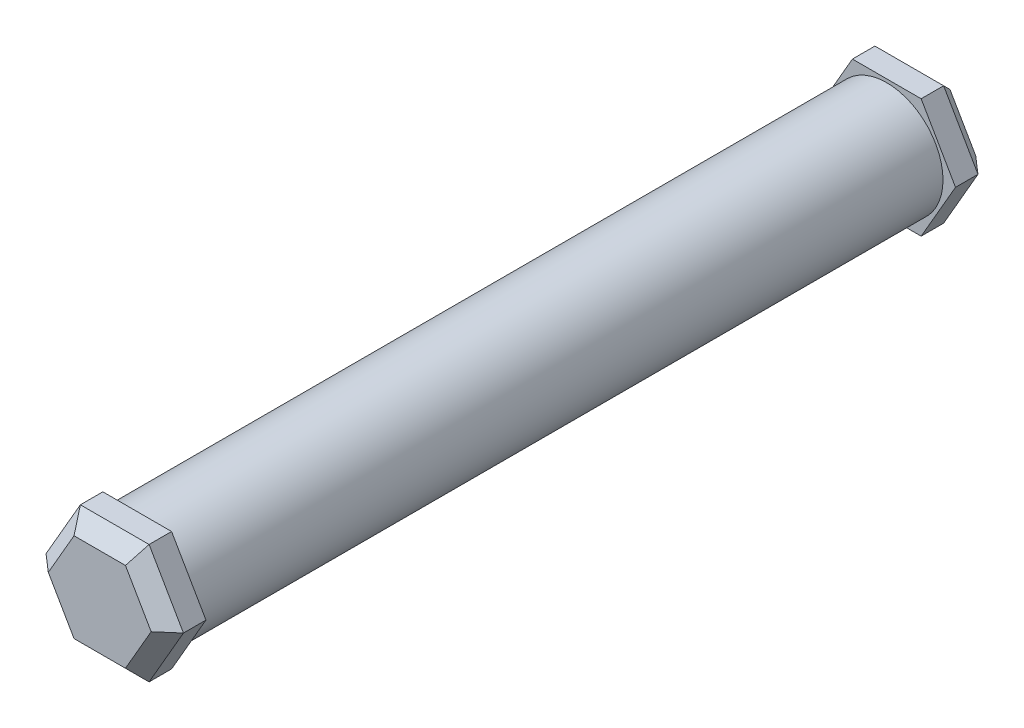
ISO-10303-21;
HEADER;
FILE_DESCRIPTION(('STEP AP214'),'2;1');
FILE_NAME('part.step','',(''),(''),'','','');
FILE_SCHEMA(('AUTOMOTIVE_DESIGN { 1 0 10303 214 1 1 1 1 }'));
ENDSEC;
DATA;
#1=APPLICATION_CONTEXT('core data for automotive mechanical design processes');
#2=APPLICATION_PROTOCOL_DEFINITION('international standard','automotive_design',2000,#1);
#3=PRODUCT_CONTEXT('',#1,'mechanical');
#4=PRODUCT('Part','Part','',(#3));
#5=PRODUCT_RELATED_PRODUCT_CATEGORY('part','',(#4));
#6=PRODUCT_DEFINITION_FORMATION('','',#4);
#7=PRODUCT_DEFINITION_CONTEXT('part definition',#1,'design');
#8=PRODUCT_DEFINITION('design','',#6,#7);
#9=PRODUCT_DEFINITION_SHAPE('','',#8);
#10=(LENGTH_UNIT() NAMED_UNIT(*) SI_UNIT(.MILLI.,.METRE.));
#11=(NAMED_UNIT(*) PLANE_ANGLE_UNIT() SI_UNIT($,.RADIAN.));
#12=(NAMED_UNIT(*) SI_UNIT($,.STERADIAN.) SOLID_ANGLE_UNIT());
#13=UNCERTAINTY_MEASURE_WITH_UNIT(LENGTH_MEASURE(1.E-05),#10,'distance_accuracy_value','');
#14=(GEOMETRIC_REPRESENTATION_CONTEXT(3) GLOBAL_UNCERTAINTY_ASSIGNED_CONTEXT((#13)) GLOBAL_UNIT_ASSIGNED_CONTEXT((#10,
#11,#12)) REPRESENTATION_CONTEXT('',''));
#15=CARTESIAN_POINT('',(0.,0.,0.));
#16=DIRECTION('',(0.,0.,1.));
#17=DIRECTION('',(1.,0.,0.));
#18=AXIS2_PLACEMENT_3D('',#15,#16,#17);
#19=CARTESIAN_POINT('',(0.,0.,200.));
#20=DIRECTION('',(0.,0.,-1.));
#21=DIRECTION('',(-1.,0.,0.));
#22=AXIS2_PLACEMENT_3D('',#19,#20,#21);
#23=CYLINDRICAL_SURFACE('',#22,15.);
#24=CARTESIAN_POINT('',(0.,0.,200.));
#25=DIRECTION('',(0.,0.,1.));
#26=DIRECTION('',(1.,0.,0.));
#27=AXIS2_PLACEMENT_3D('',#24,#25,#26);
#28=CIRCLE('',#27,15.);
#29=CARTESIAN_POINT('',(15.,0.,200.));
#30=VERTEX_POINT('',#29);
#31=EDGE_CURVE('E269',#30,#30,#28,.T.);
#32=ORIENTED_EDGE('',*,*,#31,.F.);
#33=EDGE_LOOP('',(#32));
#34=FACE_BOUND('',#33,.T.);
#35=CARTESIAN_POINT('',(0.,0.,0.));
#36=DIRECTION('',(0.,0.,1.));
#37=DIRECTION('',(1.,0.,0.));
#38=AXIS2_PLACEMENT_3D('',#35,#36,#37);
#39=CIRCLE('',#38,15.);
#40=CARTESIAN_POINT('',(15.,0.,0.));
#41=VERTEX_POINT('',#40);
#42=EDGE_CURVE('E268',#41,#41,#39,.T.);
#43=ORIENTED_EDGE('',*,*,#42,.T.);
#44=EDGE_LOOP('',(#43));
#45=FACE_BOUND('',#44,.T.);
#46=ADVANCED_FACE('F41',(#34,#45),#23,.T.);
#47=CARTESIAN_POINT('',(-9.16933017149542,-15.8817457284041,-10.));
#48=DIRECTION('',(0.866025403784438,0.500000000000001,0.));
#49=DIRECTION('',(-0.500000000000001,0.866025403784438,0.));
#50=AXIS2_PLACEMENT_3D('',#47,#48,#49);
#51=PLANE('',#50);
#52=DIRECTION('',(0.,0.,1.));
#53=VECTOR('',#52,1.);
#54=CARTESIAN_POINT('',(-18.3386603429907,-1.28058180733869E-13,-10.));
#55=LINE('',#54,#53);
#56=CARTESIAN_POINT('',(-18.3386603429907,-1.28058180733869E-13,-5.99999999999997));
#57=VERTEX_POINT('',#56);
#58=CARTESIAN_POINT('',(-18.3386603429907,-1.28058180733869E-13,0.));
#59=VERTEX_POINT('',#58);
#60=EDGE_CURVE('E265',#57,#59,#55,.T.);
#61=ORIENTED_EDGE('',*,*,#60,.F.);
#62=DIRECTION('',(0.500000000000001,-0.866025403784438,0.));
#63=VECTOR('',#62,1.);
#64=CARTESIAN_POINT('',(-9.16933017149542,-15.8817457284041,-5.99999999999997));
#65=LINE('',#64,#63);
#66=CARTESIAN_POINT('',(-9.16933017149542,-15.8817457284041,-5.99999999999997));
#67=VERTEX_POINT('',#66);
#68=EDGE_CURVE('E311',#57,#67,#65,.T.);
#69=ORIENTED_EDGE('',*,*,#68,.T.);
#70=DIRECTION('',(0.,0.,1.));
#71=VECTOR('',#70,1.);
#72=CARTESIAN_POINT('',(-9.16933017149542,-15.8817457284041,-10.));
#73=LINE('',#72,#71);
#74=CARTESIAN_POINT('',(-9.16933017149542,-15.8817457284041,0.));
#75=VERTEX_POINT('',#74);
#76=EDGE_CURVE('E250',#67,#75,#73,.T.);
#77=ORIENTED_EDGE('',*,*,#76,.T.);
#78=DIRECTION('',(-0.500000000000001,0.866025403784438,0.));
#79=VECTOR('',#78,1.);
#80=CARTESIAN_POINT('',(-9.16933017149542,-15.8817457284041,0.));
#81=LINE('',#80,#79);
#82=EDGE_CURVE('E176',#75,#59,#81,.T.);
#83=ORIENTED_EDGE('',*,*,#82,.T.);
#84=EDGE_LOOP('',(#61,#69,#77,#83));
#85=FACE_BOUND('',#84,.T.);
#86=ADVANCED_FACE('F427',(#85),#51,.F.);
#87=CARTESIAN_POINT('',(-18.3386603429907,-1.28058180733869E-13,-10.));
#88=DIRECTION('',(0.866025403784442,-0.499999999999995,0.));
#89=DIRECTION('',(0.499999999999995,0.866025403784442,0.));
#90=AXIS2_PLACEMENT_3D('',#87,#88,#89);
#91=PLANE('',#90);
#92=DIRECTION('',(0.,0.,1.));
#93=VECTOR('',#92,1.);
#94=CARTESIAN_POINT('',(-9.16933017149542,15.8817457284041,-10.));
#95=LINE('',#94,#93);
#96=CARTESIAN_POINT('',(-9.16933017149542,15.8817457284041,-5.99999999999997));
#97=VERTEX_POINT('',#96);
#98=CARTESIAN_POINT('',(-9.16933017149542,15.8817457284041,0.));
#99=VERTEX_POINT('',#98);
#100=EDGE_CURVE('E262',#97,#99,#95,.T.);
#101=ORIENTED_EDGE('',*,*,#100,.F.);
#102=DIRECTION('',(-0.499999999999995,-0.866025403784442,0.));
#103=VECTOR('',#102,1.);
#104=CARTESIAN_POINT('',(-18.3386603429907,-1.28369537222284E-13,-5.99999999999997));
#105=LINE('',#104,#103);
#106=EDGE_CURVE('E308',#97,#57,#105,.T.);
#107=ORIENTED_EDGE('',*,*,#106,.T.);
#108=ORIENTED_EDGE('',*,*,#60,.T.);
#109=DIRECTION('',(0.499999999999995,0.866025403784442,0.));
#110=VECTOR('',#109,1.);
#111=CARTESIAN_POINT('',(-18.3386603429907,-1.28058180733869E-13,0.));
#112=LINE('',#111,#110);
#113=EDGE_CURVE('E230',#59,#99,#112,.T.);
#114=ORIENTED_EDGE('',*,*,#113,.T.);
#115=EDGE_LOOP('',(#101,#107,#108,#114));
#116=FACE_BOUND('',#115,.T.);
#117=ADVANCED_FACE('F433',(#116),#91,.F.);
#118=CARTESIAN_POINT('',(-9.16933017149542,15.8817457284041,-10.));
#119=DIRECTION('',(0.,-1.,0.));
#120=DIRECTION('',(1.,0.,0.));
#121=AXIS2_PLACEMENT_3D('',#118,#119,#120);
#122=PLANE('',#121);
#123=DIRECTION('',(0.,0.,1.));
#124=VECTOR('',#123,1.);
#125=CARTESIAN_POINT('',(9.1693301714953,15.8817457284042,-10.));
#126=LINE('',#125,#124);
#127=CARTESIAN_POINT('',(9.1693301714953,15.8817457284042,-5.99999999999997));
#128=VERTEX_POINT('',#127);
#129=CARTESIAN_POINT('',(9.1693301714953,15.8817457284042,0.));
#130=VERTEX_POINT('',#129);
#131=EDGE_CURVE('E259',#128,#130,#126,.T.);
#132=ORIENTED_EDGE('',*,*,#131,.F.);
#133=DIRECTION('',(-1.,0.,0.));
#134=VECTOR('',#133,1.);
#135=CARTESIAN_POINT('',(-9.16933017149542,15.8817457284041,-5.99999999999997));
#136=LINE('',#135,#134);
#137=EDGE_CURVE('E305',#128,#97,#136,.T.);
#138=ORIENTED_EDGE('',*,*,#137,.T.);
#139=ORIENTED_EDGE('',*,*,#100,.T.);
#140=DIRECTION('',(1.,0.,0.));
#141=VECTOR('',#140,1.);
#142=CARTESIAN_POINT('',(-9.16933017149542,15.8817457284041,0.));
#143=LINE('',#142,#141);
#144=EDGE_CURVE('E234',#99,#130,#143,.T.);
#145=ORIENTED_EDGE('',*,*,#144,.T.);
#146=EDGE_LOOP('',(#132,#138,#139,#145));
#147=FACE_BOUND('',#146,.T.);
#148=ADVANCED_FACE('F628',(#147),#122,.F.);
#149=CARTESIAN_POINT('',(9.1693301714953,15.8817457284042,-10.));
#150=DIRECTION('',(-0.866025403784438,-0.500000000000001,0.));
#151=DIRECTION('',(0.500000000000001,-0.866025403784438,0.));
#152=AXIS2_PLACEMENT_3D('',#149,#150,#151);
#153=PLANE('',#152);
#154=DIRECTION('',(0.,0.,1.));
#155=VECTOR('',#154,1.);
#156=CARTESIAN_POINT('',(18.3386603429907,0.,-10.));
#157=LINE('',#156,#155);
#158=CARTESIAN_POINT('',(18.3386603429907,0.,-5.99999999999997));
#159=VERTEX_POINT('',#158);
#160=CARTESIAN_POINT('',(18.3386603429907,0.,0.));
#161=VERTEX_POINT('',#160);
#162=EDGE_CURVE('E256',#159,#161,#157,.T.);
#163=ORIENTED_EDGE('',*,*,#162,.F.);
#164=DIRECTION('',(-0.500000000000001,0.866025403784438,0.));
#165=VECTOR('',#164,1.);
#166=CARTESIAN_POINT('',(9.1693301714953,15.8817457284042,-5.99999999999997));
#167=LINE('',#166,#165);
#168=EDGE_CURVE('E302',#159,#128,#167,.T.);
#169=ORIENTED_EDGE('',*,*,#168,.T.);
#170=ORIENTED_EDGE('',*,*,#131,.T.);
#171=DIRECTION('',(0.500000000000001,-0.866025403784438,0.));
#172=VECTOR('',#171,1.);
#173=CARTESIAN_POINT('',(9.1693301714953,15.8817457284042,0.));
#174=LINE('',#173,#172);
#175=EDGE_CURVE('E238',#130,#161,#174,.T.);
#176=ORIENTED_EDGE('',*,*,#175,.T.);
#177=EDGE_LOOP('',(#163,#169,#170,#176));
#178=FACE_BOUND('',#177,.T.);
#179=ADVANCED_FACE('F618',(#178),#153,.F.);
#180=CARTESIAN_POINT('',(18.3386603429907,0.,-10.));
#181=DIRECTION('',(-0.866025403784438,0.500000000000001,0.));
#182=DIRECTION('',(-0.500000000000001,-0.866025403784438,0.));
#183=AXIS2_PLACEMENT_3D('',#180,#181,#182);
#184=PLANE('',#183);
#185=DIRECTION('',(0.,0.,1.));
#186=VECTOR('',#185,1.);
#187=CARTESIAN_POINT('',(9.1693301714953,-15.8817457284042,-10.));
#188=LINE('',#187,#186);
#189=CARTESIAN_POINT('',(9.1693301714953,-15.8817457284042,-5.99999999999997));
#190=VERTEX_POINT('',#189);
#191=CARTESIAN_POINT('',(9.1693301714953,-15.8817457284042,0.));
#192=VERTEX_POINT('',#191);
#193=EDGE_CURVE('E253',#190,#192,#188,.T.);
#194=ORIENTED_EDGE('',*,*,#193,.F.);
#195=DIRECTION('',(0.500000000000001,0.866025403784438,0.));
#196=VECTOR('',#195,1.);
#197=CARTESIAN_POINT('',(18.3386603429907,0.,-5.99999999999997));
#198=LINE('',#197,#196);
#199=EDGE_CURVE('E299',#190,#159,#198,.T.);
#200=ORIENTED_EDGE('',*,*,#199,.T.);
#201=ORIENTED_EDGE('',*,*,#162,.T.);
#202=DIRECTION('',(-0.500000000000001,-0.866025403784438,0.));
#203=VECTOR('',#202,1.);
#204=CARTESIAN_POINT('',(18.3386603429907,0.,0.));
#205=LINE('',#204,#203);
#206=EDGE_CURVE('E242',#161,#192,#205,.T.);
#207=ORIENTED_EDGE('',*,*,#206,.T.);
#208=EDGE_LOOP('',(#194,#200,#201,#207));
#209=FACE_BOUND('',#208,.T.);
#210=ADVANCED_FACE('F608',(#209),#184,.F.);
#211=CARTESIAN_POINT('',(9.1693301714953,-15.8817457284042,-10.));
#212=DIRECTION('',(0.,1.,0.));
#213=DIRECTION('',(-1.,0.,0.));
#214=AXIS2_PLACEMENT_3D('',#211,#212,#213);
#215=PLANE('',#214);
#216=ORIENTED_EDGE('',*,*,#76,.F.);
#217=DIRECTION('',(1.,0.,0.));
#218=VECTOR('',#217,1.);
#219=CARTESIAN_POINT('',(9.1693301714953,-15.8817457284042,-5.99999999999997));
#220=LINE('',#219,#218);
#221=EDGE_CURVE('E295',#67,#190,#220,.T.);
#222=ORIENTED_EDGE('',*,*,#221,.T.);
#223=ORIENTED_EDGE('',*,*,#193,.T.);
#224=DIRECTION('',(-1.,0.,0.));
#225=VECTOR('',#224,1.);
#226=CARTESIAN_POINT('',(9.1693301714953,-15.8817457284042,0.));
#227=LINE('',#226,#225);
#228=EDGE_CURVE('E246',#192,#75,#227,.T.);
#229=ORIENTED_EDGE('',*,*,#228,.T.);
#230=EDGE_LOOP('',(#216,#222,#223,#229));
#231=FACE_BOUND('',#230,.T.);
#232=ADVANCED_FACE('F598',(#231),#215,.F.);
#233=CARTESIAN_POINT('',(0.,0.,-10.));
#234=DIRECTION('',(0.,0.,-1.));
#235=DIRECTION('',(-1.,0.,0.));
#236=AXIS2_PLACEMENT_3D('',#233,#234,#235);
#237=PLANE('',#236);
#238=DIRECTION('',(-0.500000000000001,-0.866025403784438,0.));
#239=VECTOR('',#238,1.);
#240=CARTESIAN_POINT('',(5.70522855635753,-13.8817457284042,-10.));
#241=LINE('',#240,#239);
#242=CARTESIAN_POINT('',(13.7198581894736,0.,-10.));
#243=VERTEX_POINT('',#242);
#244=CARTESIAN_POINT('',(6.8599290947368,-11.8817457284042,-10.));
#245=VERTEX_POINT('',#244);
#246=EDGE_CURVE('E288',#243,#245,#241,.T.);
#247=ORIENTED_EDGE('',*,*,#246,.T.);
#248=DIRECTION('',(-1.,0.,0.));
#249=VECTOR('',#248,1.);
#250=CARTESIAN_POINT('',(-9.1693301714954,-11.8817457284041,-10.));
#251=LINE('',#250,#249);
#252=CARTESIAN_POINT('',(-6.8599290947369,-11.8817457284041,-10.));
#253=VERTEX_POINT('',#252);
#254=EDGE_CURVE('E291',#245,#253,#251,.T.);
#255=ORIENTED_EDGE('',*,*,#254,.T.);
#256=DIRECTION('',(-0.500000000000001,0.866025403784438,0.));
#257=VECTOR('',#256,1.);
#258=CARTESIAN_POINT('',(-14.8745587278529,1.99999999999989,-10.));
#259=LINE('',#258,#257);
#260=CARTESIAN_POINT('',(-13.7198581894737,-1.09537694663182E-13,-10.));
#261=VERTEX_POINT('',#260);
#262=EDGE_CURVE('E273',#253,#261,#259,.T.);
#263=ORIENTED_EDGE('',*,*,#262,.T.);
#264=DIRECTION('',(0.499999999999995,0.866025403784442,0.));
#265=VECTOR('',#264,1.);
#266=CARTESIAN_POINT('',(-5.70522855635763,13.8817457284041,-10.));
#267=LINE('',#266,#265);
#268=CARTESIAN_POINT('',(-6.85992909473688,11.8817457284041,-10.));
#269=VERTEX_POINT('',#268);
#270=EDGE_CURVE('E279',#261,#269,#267,.T.);
#271=ORIENTED_EDGE('',*,*,#270,.T.);
#272=DIRECTION('',(1.,0.,0.));
#273=VECTOR('',#272,1.);
#274=CARTESIAN_POINT('',(9.16933017149532,11.8817457284042,-10.));
#275=LINE('',#274,#273);
#276=CARTESIAN_POINT('',(6.85992909473679,11.8817457284042,-10.));
#277=VERTEX_POINT('',#276);
#278=EDGE_CURVE('E282',#269,#277,#275,.T.);
#279=ORIENTED_EDGE('',*,*,#278,.T.);
#280=DIRECTION('',(0.500000000000001,-0.866025403784438,0.));
#281=VECTOR('',#280,1.);
#282=CARTESIAN_POINT('',(14.8745587278529,-2.00000000000001,-10.));
#283=LINE('',#282,#281);
#284=EDGE_CURVE('E285',#277,#243,#283,.T.);
#285=ORIENTED_EDGE('',*,*,#284,.T.);
#286=EDGE_LOOP('',(#247,#255,#263,#271,#279,#285));
#287=FACE_BOUND('',#286,.T.);
#288=ADVANCED_FACE('F593',(#287),#237,.T.);
#289=CARTESIAN_POINT('',(0.,0.,0.));
#290=DIRECTION('',(0.,0.,-1.));
#291=DIRECTION('',(-1.,0.,0.));
#292=AXIS2_PLACEMENT_3D('',#289,#290,#291);
#293=PLANE('',#292);
#294=ORIENTED_EDGE('',*,*,#42,.F.);
#295=EDGE_LOOP('',(#294));
#296=FACE_BOUND('',#295,.T.);
#297=ORIENTED_EDGE('',*,*,#82,.F.);
#298=ORIENTED_EDGE('',*,*,#228,.F.);
#299=ORIENTED_EDGE('',*,*,#206,.F.);
#300=ORIENTED_EDGE('',*,*,#175,.F.);
#301=ORIENTED_EDGE('',*,*,#144,.F.);
#302=ORIENTED_EDGE('',*,*,#113,.F.);
#303=EDGE_LOOP('',(#297,#298,#299,#300,#301,#302));
#304=FACE_BOUND('',#303,.T.);
#305=ADVANCED_FACE('F586',(#296,#304),#293,.F.);
#306=CARTESIAN_POINT('',(9.16933017149553,-15.8817457284041,210.));
#307=DIRECTION('',(-0.866025403784442,0.499999999999995,0.));
#308=DIRECTION('',(-0.499999999999995,-0.866025403784442,0.));
#309=AXIS2_PLACEMENT_3D('',#306,#307,#308);
#310=PLANE('',#309);
#311=DIRECTION('',(0.,0.,-1.));
#312=VECTOR('',#311,1.);
#313=CARTESIAN_POINT('',(18.3386603429907,0.,210.));
#314=LINE('',#313,#312);
#315=CARTESIAN_POINT('',(18.3386603429907,0.,206.));
#316=VERTEX_POINT('',#315);
#317=CARTESIAN_POINT('',(18.3386603429907,0.,200.));
#318=VERTEX_POINT('',#317);
#319=EDGE_CURVE('E167',#316,#318,#314,.T.);
#320=ORIENTED_EDGE('',*,*,#319,.F.);
#321=DIRECTION('',(-0.499999999999995,-0.866025403784442,0.));
#322=VECTOR('',#321,1.);
#323=CARTESIAN_POINT('',(9.16933017149553,-15.8817457284041,206.));
#324=LINE('',#323,#322);
#325=CARTESIAN_POINT('',(9.16933017149553,-15.8817457284041,206.));
#326=VERTEX_POINT('',#325);
#327=EDGE_CURVE('E11',#316,#326,#324,.T.);
#328=ORIENTED_EDGE('',*,*,#327,.T.);
#329=DIRECTION('',(0.,0.,-1.));
#330=VECTOR('',#329,1.);
#331=CARTESIAN_POINT('',(9.16933017149553,-15.8817457284041,210.));
#332=LINE('',#331,#330);
#333=CARTESIAN_POINT('',(9.16933017149553,-15.8817457284041,200.));
#334=VERTEX_POINT('',#333);
#335=EDGE_CURVE('E191',#326,#334,#332,.T.);
#336=ORIENTED_EDGE('',*,*,#335,.T.);
#337=DIRECTION('',(0.499999999999995,0.866025403784441,0.));
#338=VECTOR('',#337,1.);
#339=CARTESIAN_POINT('',(9.16933017149553,-15.8817457284041,200.));
#340=LINE('',#339,#338);
#341=EDGE_CURVE('E183',#334,#318,#340,.T.);
#342=ORIENTED_EDGE('',*,*,#341,.T.);
#343=EDGE_LOOP('',(#320,#328,#336,#342));
#344=FACE_BOUND('',#343,.T.);
#345=ADVANCED_FACE('F189',(#344),#310,.F.);
#346=CARTESIAN_POINT('',(18.3386603429907,0.,210.));
#347=DIRECTION('',(-0.866025403784438,-0.500000000000001,0.));
#348=DIRECTION('',(0.500000000000001,-0.866025403784438,0.));
#349=AXIS2_PLACEMENT_3D('',#346,#347,#348);
#350=PLANE('',#349);
#351=DIRECTION('',(0.,0.,-1.));
#352=VECTOR('',#351,1.);
#353=CARTESIAN_POINT('',(9.16933017149531,15.8817457284042,210.));
#354=LINE('',#353,#352);
#355=CARTESIAN_POINT('',(9.16933017149531,15.8817457284042,206.));
#356=VERTEX_POINT('',#355);
#357=CARTESIAN_POINT('',(9.16933017149531,15.8817457284042,200.));
#358=VERTEX_POINT('',#357);
#359=EDGE_CURVE('E177',#356,#358,#354,.T.);
#360=ORIENTED_EDGE('',*,*,#359,.F.);
#361=DIRECTION('',(0.500000000000001,-0.866025403784438,0.));
#362=VECTOR('',#361,1.);
#363=CARTESIAN_POINT('',(18.3386603429907,0.,206.));
#364=LINE('',#363,#362);
#365=EDGE_CURVE('E52',#356,#316,#364,.T.);
#366=ORIENTED_EDGE('',*,*,#365,.T.);
#367=ORIENTED_EDGE('',*,*,#319,.T.);
#368=DIRECTION('',(-0.500000000000001,0.866025403784438,0.));
#369=VECTOR('',#368,1.);
#370=CARTESIAN_POINT('',(18.3386603429907,0.,200.));
#371=LINE('',#370,#369);
#372=EDGE_CURVE('E170',#318,#358,#371,.T.);
#373=ORIENTED_EDGE('',*,*,#372,.T.);
#374=EDGE_LOOP('',(#360,#366,#367,#373));
#375=FACE_BOUND('',#374,.T.);
#376=ADVANCED_FACE('F169',(#375),#350,.F.);
#377=CARTESIAN_POINT('',(9.16933017149531,15.8817457284042,210.));
#378=DIRECTION('',(0.,-1.,0.));
#379=DIRECTION('',(1.,0.,0.));
#380=AXIS2_PLACEMENT_3D('',#377,#378,#379);
#381=PLANE('',#380);
#382=DIRECTION('',(0.,0.,-1.));
#383=VECTOR('',#382,1.);
#384=CARTESIAN_POINT('',(-9.16933017149542,15.8817457284041,210.));
#385=LINE('',#384,#383);
#386=CARTESIAN_POINT('',(-9.16933017149542,15.8817457284041,206.));
#387=VERTEX_POINT('',#386);
#388=CARTESIAN_POINT('',(-9.16933017149542,15.8817457284041,200.));
#389=VERTEX_POINT('',#388);
#390=EDGE_CURVE('E222',#387,#389,#385,.T.);
#391=ORIENTED_EDGE('',*,*,#390,.F.);
#392=DIRECTION('',(1.,0.,0.));
#393=VECTOR('',#392,1.);
#394=CARTESIAN_POINT('',(9.16933017149531,15.8817457284042,206.));
#395=LINE('',#394,#393);
#396=EDGE_CURVE('E67',#387,#356,#395,.T.);
#397=ORIENTED_EDGE('',*,*,#396,.T.);
#398=ORIENTED_EDGE('',*,*,#359,.T.);
#399=DIRECTION('',(-1.,0.,0.));
#400=VECTOR('',#399,1.);
#401=CARTESIAN_POINT('',(9.16933017149531,15.8817457284042,200.));
#402=LINE('',#401,#400);
#403=EDGE_CURVE('E186',#358,#389,#402,.T.);
#404=ORIENTED_EDGE('',*,*,#403,.T.);
#405=EDGE_LOOP('',(#391,#397,#398,#404));
#406=FACE_BOUND('',#405,.T.);
#407=ADVANCED_FACE('F417',(#406),#381,.F.);
#408=CARTESIAN_POINT('',(-9.16933017149542,15.8817457284041,210.));
#409=DIRECTION('',(0.866025403784442,-0.499999999999995,0.));
#410=DIRECTION('',(0.499999999999995,0.866025403784442,0.));
#411=AXIS2_PLACEMENT_3D('',#408,#409,#410);
#412=PLANE('',#411);
#413=DIRECTION('',(0.,0.,-1.));
#414=VECTOR('',#413,1.);
#415=CARTESIAN_POINT('',(-18.3386603429907,-1.28058180733869E-13,210.));
#416=LINE('',#415,#414);
#417=CARTESIAN_POINT('',(-18.3386603429907,-1.28058180733869E-13,206.));
#418=VERTEX_POINT('',#417);
#419=CARTESIAN_POINT('',(-18.3386603429907,-1.28058180733869E-13,200.));
#420=VERTEX_POINT('',#419);
#421=EDGE_CURVE('E219',#418,#420,#416,.T.);
#422=ORIENTED_EDGE('',*,*,#421,.F.);
#423=DIRECTION('',(0.499999999999995,0.866025403784442,0.));
#424=VECTOR('',#423,1.);
#425=CARTESIAN_POINT('',(-9.16933017149542,15.8817457284041,206.));
#426=LINE('',#425,#424);
#427=EDGE_CURVE('E340',#418,#387,#426,.T.);
#428=ORIENTED_EDGE('',*,*,#427,.T.);
#429=ORIENTED_EDGE('',*,*,#390,.T.);
#430=DIRECTION('',(-0.499999999999995,-0.866025403784442,0.));
#431=VECTOR('',#430,1.);
#432=CARTESIAN_POINT('',(-9.16933017149542,15.8817457284041,200.));
#433=LINE('',#432,#431);
#434=EDGE_CURVE('E203',#389,#420,#433,.T.);
#435=ORIENTED_EDGE('',*,*,#434,.T.);
#436=EDGE_LOOP('',(#422,#428,#429,#435));
#437=FACE_BOUND('',#436,.T.);
#438=ADVANCED_FACE('F415',(#437),#412,.F.);
#439=CARTESIAN_POINT('',(-18.3386603429907,-1.28058180733869E-13,210.));
#440=DIRECTION('',(0.866025403784435,0.500000000000007,0.));
#441=DIRECTION('',(-0.500000000000007,0.866025403784435,0.));
#442=AXIS2_PLACEMENT_3D('',#439,#440,#441);
#443=PLANE('',#442);
#444=DIRECTION('',(0.,0.,-1.));
#445=VECTOR('',#444,1.);
#446=CARTESIAN_POINT('',(-9.1693301714952,-15.8817457284043,210.));
#447=LINE('',#446,#445);
#448=CARTESIAN_POINT('',(-9.1693301714952,-15.8817457284043,206.));
#449=VERTEX_POINT('',#448);
#450=CARTESIAN_POINT('',(-9.1693301714952,-15.8817457284043,200.));
#451=VERTEX_POINT('',#450);
#452=EDGE_CURVE('E216',#449,#451,#447,.T.);
#453=ORIENTED_EDGE('',*,*,#452,.F.);
#454=DIRECTION('',(-0.500000000000007,0.866025403784435,0.));
#455=VECTOR('',#454,1.);
#456=CARTESIAN_POINT('',(-18.3386603429907,-1.28369537222284E-13,206.));
#457=LINE('',#456,#455);
#458=EDGE_CURVE('E337',#449,#418,#457,.T.);
#459=ORIENTED_EDGE('',*,*,#458,.T.);
#460=ORIENTED_EDGE('',*,*,#421,.T.);
#461=DIRECTION('',(0.500000000000007,-0.866025403784435,0.));
#462=VECTOR('',#461,1.);
#463=CARTESIAN_POINT('',(-18.3386603429907,-1.28058180733869E-13,200.));
#464=LINE('',#463,#462);
#465=EDGE_CURVE('E207',#420,#451,#464,.T.);
#466=ORIENTED_EDGE('',*,*,#465,.T.);
#467=EDGE_LOOP('',(#453,#459,#460,#466));
#468=FACE_BOUND('',#467,.T.);
#469=ADVANCED_FACE('F413',(#468),#443,.F.);
#470=CARTESIAN_POINT('',(-9.1693301714952,-15.8817457284043,210.));
#471=DIRECTION('',(0.,1.,0.));
#472=DIRECTION('',(-1.,0.,0.));
#473=AXIS2_PLACEMENT_3D('',#470,#471,#472);
#474=PLANE('',#473);
#475=ORIENTED_EDGE('',*,*,#335,.F.);
#476=DIRECTION('',(-1.,0.,0.));
#477=VECTOR('',#476,1.);
#478=CARTESIAN_POINT('',(-9.1693301714952,-15.8817457284043,206.));
#479=LINE('',#478,#477);
#480=EDGE_CURVE('E333',#326,#449,#479,.T.);
#481=ORIENTED_EDGE('',*,*,#480,.T.);
#482=ORIENTED_EDGE('',*,*,#452,.T.);
#483=DIRECTION('',(1.,0.,0.));
#484=VECTOR('',#483,1.);
#485=CARTESIAN_POINT('',(-9.1693301714952,-15.8817457284043,200.));
#486=LINE('',#485,#484);
#487=EDGE_CURVE('E211',#451,#334,#486,.T.);
#488=ORIENTED_EDGE('',*,*,#487,.T.);
#489=EDGE_LOOP('',(#475,#481,#482,#488));
#490=FACE_BOUND('',#489,.T.);
#491=ADVANCED_FACE('F401',(#490),#474,.F.);
#492=CARTESIAN_POINT('',(0.,0.,210.));
#493=DIRECTION('',(0.,0.,1.));
#494=DIRECTION('',(1.,0.,0.));
#495=AXIS2_PLACEMENT_3D('',#492,#493,#494);
#496=PLANE('',#495);
#497=DIRECTION('',(0.500000000000007,-0.866025403784435,0.));
#498=VECTOR('',#497,1.);
#499=CARTESIAN_POINT('',(-5.70522855635745,-13.8817457284042,210.));
#500=LINE('',#499,#498);
#501=CARTESIAN_POINT('',(-13.7198581894737,0.,210.));
#502=VERTEX_POINT('',#501);
#503=CARTESIAN_POINT('',(-6.85992909473672,-11.8817457284042,210.));
#504=VERTEX_POINT('',#503);
#505=EDGE_CURVE('E326',#502,#504,#500,.T.);
#506=ORIENTED_EDGE('',*,*,#505,.T.);
#507=DIRECTION('',(1.,0.,0.));
#508=VECTOR('',#507,1.);
#509=CARTESIAN_POINT('',(9.16933017149549,-11.8817457284041,210.));
#510=LINE('',#509,#508);
#511=CARTESIAN_POINT('',(6.85992909473699,-11.8817457284041,210.));
#512=VERTEX_POINT('',#511);
#513=EDGE_CURVE('E329',#504,#512,#510,.T.);
#514=ORIENTED_EDGE('',*,*,#513,.T.);
#515=DIRECTION('',(0.499999999999995,0.866025403784442,0.));
#516=VECTOR('',#515,1.);
#517=CARTESIAN_POINT('',(14.8745587278529,1.99999999999998,210.));
#518=LINE('',#517,#516);
#519=CARTESIAN_POINT('',(13.7198581894737,0.,210.));
#520=VERTEX_POINT('',#519);
#521=EDGE_CURVE('E314',#512,#520,#518,.T.);
#522=ORIENTED_EDGE('',*,*,#521,.T.);
#523=DIRECTION('',(-0.500000000000001,0.866025403784438,0.));
#524=VECTOR('',#523,1.);
#525=CARTESIAN_POINT('',(5.70522855635755,13.8817457284042,210.));
#526=LINE('',#525,#524);
#527=CARTESIAN_POINT('',(6.85992909473681,11.8817457284042,210.));
#528=VERTEX_POINT('',#527);
#529=EDGE_CURVE('E317',#520,#528,#526,.T.);
#530=ORIENTED_EDGE('',*,*,#529,.T.);
#531=DIRECTION('',(-1.,0.,0.));
#532=VECTOR('',#531,1.);
#533=CARTESIAN_POINT('',(-9.1693301714954,11.8817457284041,210.));
#534=LINE('',#533,#532);
#535=CARTESIAN_POINT('',(-6.85992909473688,11.8817457284041,210.));
#536=VERTEX_POINT('',#535);
#537=EDGE_CURVE('E320',#528,#536,#534,.T.);
#538=ORIENTED_EDGE('',*,*,#537,.T.);
#539=DIRECTION('',(-0.499999999999995,-0.866025403784442,0.));
#540=VECTOR('',#539,1.);
#541=CARTESIAN_POINT('',(-14.8745587278529,-2.00000000000011,210.));
#542=LINE('',#541,#540);
#543=EDGE_CURVE('E323',#536,#502,#542,.T.);
#544=ORIENTED_EDGE('',*,*,#543,.T.);
#545=EDGE_LOOP('',(#506,#514,#522,#530,#538,#544));
#546=FACE_BOUND('',#545,.T.);
#547=ADVANCED_FACE('F541',(#546),#496,.T.);
#548=CARTESIAN_POINT('',(0.,0.,200.));
#549=DIRECTION('',(0.,0.,1.));
#550=DIRECTION('',(1.,0.,0.));
#551=AXIS2_PLACEMENT_3D('',#548,#549,#550);
#552=PLANE('',#551);
#553=ORIENTED_EDGE('',*,*,#31,.T.);
#554=EDGE_LOOP('',(#553));
#555=FACE_BOUND('',#554,.T.);
#556=ORIENTED_EDGE('',*,*,#341,.F.);
#557=ORIENTED_EDGE('',*,*,#487,.F.);
#558=ORIENTED_EDGE('',*,*,#465,.F.);
#559=ORIENTED_EDGE('',*,*,#434,.F.);
#560=ORIENTED_EDGE('',*,*,#403,.F.);
#561=ORIENTED_EDGE('',*,*,#372,.F.);
#562=EDGE_LOOP('',(#556,#557,#558,#559,#560,#561));
#563=FACE_BOUND('',#562,.T.);
#564=ADVANCED_FACE('F181',(#555,#563),#552,.F.);
#565=CARTESIAN_POINT('',(0.,11.8817457284041,-10.));
#566=DIRECTION('',(0.,0.707106781186548,-0.707106781186547));
#567=DIRECTION('',(-1.,0.,0.));
#568=AXIS2_PLACEMENT_3D('',#565,#566,#567);
#569=PLANE('',#568);
#570=DIRECTION('',(0.37796447300923,-0.654653670707975,-0.654653670707978));
#571=VECTOR('',#570,1.);
#572=CARTESIAN_POINT('',(-5.87993922406018,10.1843534814892,-11.6973922469149));
#573=LINE('',#572,#571);
#574=EDGE_CURVE('E198',#97,#269,#573,.T.);
#575=ORIENTED_EDGE('',*,*,#574,.F.);
#576=ORIENTED_EDGE('',*,*,#137,.F.);
#577=DIRECTION('',(-0.377964473009225,-0.654653670707978,-0.654653670707978));
#578=VECTOR('',#577,1.);
#579=CARTESIAN_POINT('',(5.87993922406011,10.1843534814893,-11.6973922469149));
#580=LINE('',#579,#578);
#581=EDGE_CURVE('E194',#277,#128,#580,.F.);
#582=ORIENTED_EDGE('',*,*,#581,.F.);
#583=ORIENTED_EDGE('',*,*,#278,.F.);
#584=EDGE_LOOP('',(#575,#576,#582,#583));
#585=FACE_BOUND('',#584,.T.);
#586=ADVANCED_FACE('F475',(#585),#569,.T.);
#587=CARTESIAN_POINT('',(10.2898936421052,5.94087286420208,-10.));
#588=DIRECTION('',(0.612372435695795,0.353553390593275,-0.707106781186547));
#589=DIRECTION('',(-0.500000000000001,0.866025403784438,0.));
#590=AXIS2_PLACEMENT_3D('',#587,#588,#589);
#591=PLANE('',#590);
#592=ORIENTED_EDGE('',*,*,#581,.T.);
#593=ORIENTED_EDGE('',*,*,#168,.F.);
#594=DIRECTION('',(-0.755928946018454,0.,-0.654653670707978));
#595=VECTOR('',#594,1.);
#596=CARTESIAN_POINT('',(11.7598784481203,0.,-11.6973922469149));
#597=LINE('',#596,#595);
#598=EDGE_CURVE('E357',#243,#159,#597,.F.);
#599=ORIENTED_EDGE('',*,*,#598,.F.);
#600=ORIENTED_EDGE('',*,*,#284,.F.);
#601=EDGE_LOOP('',(#592,#593,#599,#600));
#602=FACE_BOUND('',#601,.T.);
#603=ADVANCED_FACE('F468',(#602),#591,.T.);
#604=CARTESIAN_POINT('',(-10.2898936421053,5.94087286420201,-10.));
#605=DIRECTION('',(-0.612372435695797,0.353553390593271,-0.707106781186547));
#606=DIRECTION('',(-0.499999999999995,-0.866025403784442,0.));
#607=AXIS2_PLACEMENT_3D('',#604,#605,#606);
#608=PLANE('',#607);
#609=ORIENTED_EDGE('',*,*,#574,.T.);
#610=ORIENTED_EDGE('',*,*,#270,.F.);
#611=DIRECTION('',(0.755928946018453,0.,-0.654653670707979));
#612=VECTOR('',#611,1.);
#613=CARTESIAN_POINT('',(-11.7598784481203,-1.0321604682062E-13,-11.6973922469149));
#614=LINE('',#613,#612);
#615=EDGE_CURVE('E353',#57,#261,#614,.T.);
#616=ORIENTED_EDGE('',*,*,#615,.F.);
#617=ORIENTED_EDGE('',*,*,#106,.F.);
#618=EDGE_LOOP('',(#609,#610,#616,#617));
#619=FACE_BOUND('',#618,.T.);
#620=ADVANCED_FACE('F461',(#619),#608,.T.);
#621=CARTESIAN_POINT('',(10.2898936421052,-5.94087286420208,-10.));
#622=DIRECTION('',(0.612372435695795,-0.353553390593275,-0.707106781186547));
#623=DIRECTION('',(0.500000000000001,0.866025403784438,0.));
#624=AXIS2_PLACEMENT_3D('',#621,#622,#623);
#625=PLANE('',#624);
#626=ORIENTED_EDGE('',*,*,#598,.T.);
#627=ORIENTED_EDGE('',*,*,#199,.F.);
#628=DIRECTION('',(-0.377964473009226,0.654653670707978,-0.654653670707978));
#629=VECTOR('',#628,1.);
#630=CARTESIAN_POINT('',(5.87993922406011,-10.1843534814893,-11.6973922469149));
#631=LINE('',#630,#629);
#632=EDGE_CURVE('E350',#245,#190,#631,.F.);
#633=ORIENTED_EDGE('',*,*,#632,.F.);
#634=ORIENTED_EDGE('',*,*,#246,.F.);
#635=EDGE_LOOP('',(#626,#627,#633,#634));
#636=FACE_BOUND('',#635,.T.);
#637=ADVANCED_FACE('F454',(#636),#625,.T.);
#638=CARTESIAN_POINT('',(-10.2898936421053,-5.94087286420212,-10.));
#639=DIRECTION('',(-0.612372435695795,-0.353553390593275,-0.707106781186547));
#640=DIRECTION('',(0.500000000000001,-0.866025403784438,0.));
#641=AXIS2_PLACEMENT_3D('',#638,#639,#640);
#642=PLANE('',#641);
#643=ORIENTED_EDGE('',*,*,#615,.T.);
#644=ORIENTED_EDGE('',*,*,#262,.F.);
#645=DIRECTION('',(-0.377964473009227,-0.654653670707976,0.654653670707979));
#646=VECTOR('',#645,1.);
#647=CARTESIAN_POINT('',(-5.87993922406023,-10.1843534814893,-11.6973922469149));
#648=LINE('',#647,#646);
#649=EDGE_CURVE('E347',#67,#253,#648,.F.);
#650=ORIENTED_EDGE('',*,*,#649,.F.);
#651=ORIENTED_EDGE('',*,*,#68,.F.);
#652=EDGE_LOOP('',(#643,#644,#650,#651));
#653=FACE_BOUND('',#652,.T.);
#654=ADVANCED_FACE('F447',(#653),#642,.T.);
#655=CARTESIAN_POINT('',(0.,-11.8817457284041,-10.));
#656=DIRECTION('',(0.,-0.707106781186548,-0.707106781186547));
#657=DIRECTION('',(1.,0.,0.));
#658=AXIS2_PLACEMENT_3D('',#655,#656,#657);
#659=PLANE('',#658);
#660=ORIENTED_EDGE('',*,*,#632,.T.);
#661=ORIENTED_EDGE('',*,*,#221,.F.);
#662=ORIENTED_EDGE('',*,*,#649,.T.);
#663=ORIENTED_EDGE('',*,*,#254,.F.);
#664=EDGE_LOOP('',(#660,#661,#662,#663));
#665=FACE_BOUND('',#664,.T.);
#666=ADVANCED_FACE('F441',(#665),#659,.T.);
#667=CARTESIAN_POINT('',(0.,11.8817457284042,210.));
#668=DIRECTION('',(0.,0.707106781186547,0.707106781186548));
#669=DIRECTION('',(1.,0.,0.));
#670=AXIS2_PLACEMENT_3D('',#667,#668,#669);
#671=PLANE('',#670);
#672=DIRECTION('',(-0.377964473009226,-0.654653670707979,0.654653670707976));
#673=VECTOR('',#672,1.);
#674=CARTESIAN_POINT('',(5.87993922406011,10.1843534814893,211.697392246915));
#675=LINE('',#674,#673);
#676=EDGE_CURVE('E377',#356,#528,#675,.T.);
#677=ORIENTED_EDGE('',*,*,#676,.F.);
#678=ORIENTED_EDGE('',*,*,#396,.F.);
#679=DIRECTION('',(0.377964473009231,-0.654653670707976,0.654653670707976));
#680=VECTOR('',#679,1.);
#681=CARTESIAN_POINT('',(-5.87993922406018,10.1843534814893,211.697392246915));
#682=LINE('',#681,#680);
#683=EDGE_CURVE('E46',#536,#387,#682,.F.);
#684=ORIENTED_EDGE('',*,*,#683,.F.);
#685=ORIENTED_EDGE('',*,*,#537,.F.);
#686=EDGE_LOOP('',(#677,#678,#684,#685));
#687=FACE_BOUND('',#686,.T.);
#688=ADVANCED_FACE('F44',(#687),#671,.T.);
#689=CARTESIAN_POINT('',(-10.2898936421053,5.94087286420202,210.));
#690=DIRECTION('',(-0.612372435695796,0.35355339059327,0.707106781186548));
#691=DIRECTION('',(0.499999999999995,0.866025403784442,0.));
#692=AXIS2_PLACEMENT_3D('',#689,#690,#691);
#693=PLANE('',#692);
#694=ORIENTED_EDGE('',*,*,#683,.T.);
#695=ORIENTED_EDGE('',*,*,#427,.F.);
#696=DIRECTION('',(0.755928946018455,0.,0.654653670707976));
#697=VECTOR('',#696,1.);
#698=CARTESIAN_POINT('',(-11.7598784481203,0.,211.697392246915));
#699=LINE('',#698,#697);
#700=EDGE_CURVE('E374',#502,#418,#699,.F.);
#701=ORIENTED_EDGE('',*,*,#700,.F.);
#702=ORIENTED_EDGE('',*,*,#543,.F.);
#703=EDGE_LOOP('',(#694,#695,#701,#702));
#704=FACE_BOUND('',#703,.T.);
#705=ADVANCED_FACE('F389',(#704),#693,.T.);
#706=CARTESIAN_POINT('',(10.2898936421052,5.94087286420209,210.));
#707=DIRECTION('',(0.612372435695794,0.353553390593274,0.707106781186548));
#708=DIRECTION('',(0.500000000000001,-0.866025403784438,0.));
#709=AXIS2_PLACEMENT_3D('',#706,#707,#708);
#710=PLANE('',#709);
#711=ORIENTED_EDGE('',*,*,#676,.T.);
#712=ORIENTED_EDGE('',*,*,#529,.F.);
#713=DIRECTION('',(-0.755928946018454,0.,0.654653670707977));
#714=VECTOR('',#713,1.);
#715=CARTESIAN_POINT('',(11.7598784481203,0.,211.697392246915));
#716=LINE('',#715,#714);
#717=EDGE_CURVE('E370',#316,#520,#716,.T.);
#718=ORIENTED_EDGE('',*,*,#717,.F.);
#719=ORIENTED_EDGE('',*,*,#365,.F.);
#720=EDGE_LOOP('',(#711,#712,#718,#719));
#721=FACE_BOUND('',#720,.T.);
#722=ADVANCED_FACE('F393',(#721),#710,.T.);
#723=CARTESIAN_POINT('',(-10.2898936421052,-5.94087286420216,210.));
#724=DIRECTION('',(-0.612372435695791,-0.353553390593278,0.707106781186548));
#725=DIRECTION('',(-0.500000000000007,0.866025403784435,0.));
#726=AXIS2_PLACEMENT_3D('',#723,#724,#725);
#727=PLANE('',#726);
#728=ORIENTED_EDGE('',*,*,#700,.T.);
#729=ORIENTED_EDGE('',*,*,#458,.F.);
#730=DIRECTION('',(0.377964473009222,0.654653670707981,0.654653670707976));
#731=VECTOR('',#730,1.);
#732=CARTESIAN_POINT('',(-5.87993922406004,-10.1843534814893,211.697392246915));
#733=LINE('',#732,#731);
#734=EDGE_CURVE('E367',#504,#449,#733,.F.);
#735=ORIENTED_EDGE('',*,*,#734,.F.);
#736=ORIENTED_EDGE('',*,*,#505,.F.);
#737=EDGE_LOOP('',(#728,#729,#735,#736));
#738=FACE_BOUND('',#737,.T.);
#739=ADVANCED_FACE('F410',(#738),#727,.T.);
#740=CARTESIAN_POINT('',(10.2898936421053,-5.94087286420205,210.));
#741=DIRECTION('',(0.612372435695796,-0.35355339059327,0.707106781186548));
#742=DIRECTION('',(-0.499999999999995,-0.866025403784442,0.));
#743=AXIS2_PLACEMENT_3D('',#740,#741,#742);
#744=PLANE('',#743);
#745=ORIENTED_EDGE('',*,*,#717,.T.);
#746=ORIENTED_EDGE('',*,*,#521,.F.);
#747=DIRECTION('',(0.377964473009233,-0.654653670707974,-0.654653670707977));
#748=VECTOR('',#747,1.);
#749=CARTESIAN_POINT('',(5.8799392240603,-10.1843534814892,211.697392246915));
#750=LINE('',#749,#748);
#751=EDGE_CURVE('E364',#326,#512,#750,.F.);
#752=ORIENTED_EDGE('',*,*,#751,.F.);
#753=ORIENTED_EDGE('',*,*,#327,.F.);
#754=EDGE_LOOP('',(#745,#746,#752,#753));
#755=FACE_BOUND('',#754,.T.);
#756=ADVANCED_FACE('F398',(#755),#744,.T.);
#757=CARTESIAN_POINT('',(1.23633336087064E-13,-11.8817457284042,210.));
#758=DIRECTION('',(0.,-0.707106781186547,0.707106781186548));
#759=DIRECTION('',(-1.,0.,0.));
#760=AXIS2_PLACEMENT_3D('',#757,#758,#759);
#761=PLANE('',#760);
#762=ORIENTED_EDGE('',*,*,#734,.T.);
#763=ORIENTED_EDGE('',*,*,#480,.F.);
#764=ORIENTED_EDGE('',*,*,#751,.T.);
#765=ORIENTED_EDGE('',*,*,#513,.F.);
#766=EDGE_LOOP('',(#762,#763,#764,#765));
#767=FACE_BOUND('',#766,.T.);
#768=ADVANCED_FACE('F404',(#767),#761,.T.);
#769=CLOSED_SHELL('',(#46,#86,#117,#148,#179,#210,#232,#288,#305,#345,#376,#407,#438,#469,#491,
#547,#564,#586,#603,#620,#637,#654,#666,#688,#705,#722,#739,#756,#768));
#770=MANIFOLD_SOLID_BREP('B2',#769);
#771=ADVANCED_BREP_SHAPE_REPRESENTATION('',(#18,#770),#14);
#772=SHAPE_DEFINITION_REPRESENTATION(#9,#771);
ENDSEC;
END-ISO-10303-21;
